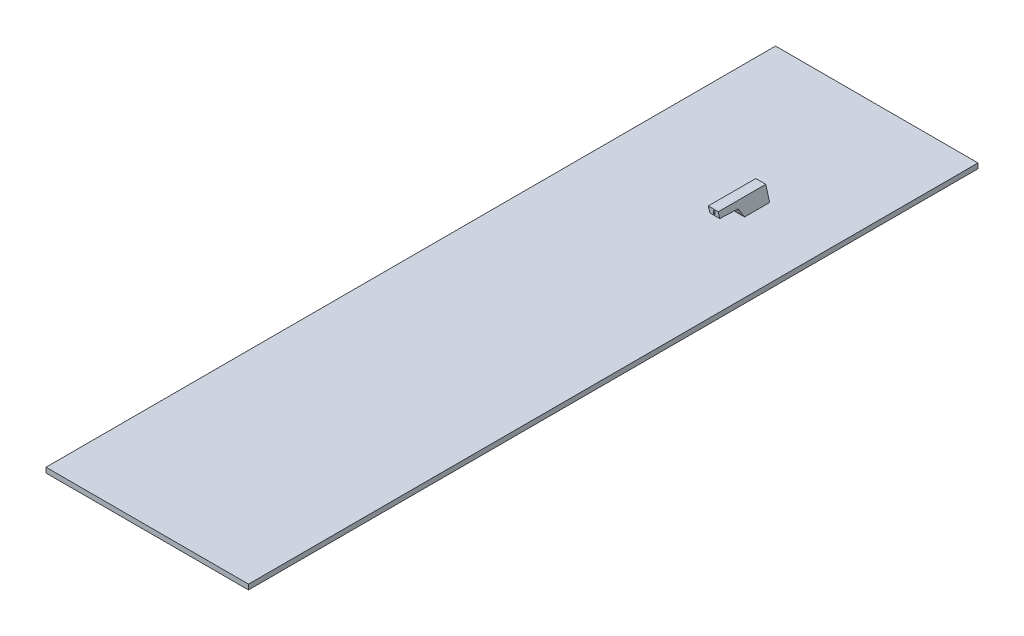
ISO-10303-21;
HEADER;
FILE_DESCRIPTION(('STEP AP214'),'2;1');
FILE_NAME('part.step','',(''),(''),'','','');
FILE_SCHEMA(('AUTOMOTIVE_DESIGN { 1 0 10303 214 1 1 1 1 }'));
ENDSEC;
DATA;
#1=APPLICATION_CONTEXT('core data for automotive mechanical design processes');
#2=APPLICATION_PROTOCOL_DEFINITION('international standard','automotive_design',2000,#1);
#3=PRODUCT_CONTEXT('',#1,'mechanical');
#4=PRODUCT('Part','Part','',(#3));
#5=PRODUCT_RELATED_PRODUCT_CATEGORY('part','',(#4));
#6=PRODUCT_DEFINITION_FORMATION('','',#4);
#7=PRODUCT_DEFINITION_CONTEXT('part definition',#1,'design');
#8=PRODUCT_DEFINITION('design','',#6,#7);
#9=PRODUCT_DEFINITION_SHAPE('','',#8);
#10=(LENGTH_UNIT() NAMED_UNIT(*) SI_UNIT(.MILLI.,.METRE.));
#11=(NAMED_UNIT(*) PLANE_ANGLE_UNIT() SI_UNIT($,.RADIAN.));
#12=(NAMED_UNIT(*) SI_UNIT($,.STERADIAN.) SOLID_ANGLE_UNIT());
#13=UNCERTAINTY_MEASURE_WITH_UNIT(LENGTH_MEASURE(1.E-05),#10,'distance_accuracy_value','');
#14=(GEOMETRIC_REPRESENTATION_CONTEXT(3) GLOBAL_UNCERTAINTY_ASSIGNED_CONTEXT((#13)) GLOBAL_UNIT_ASSIGNED_CONTEXT((#10,
#11,#12)) REPRESENTATION_CONTEXT('',''));
#15=CARTESIAN_POINT('',(0.,0.,0.));
#16=DIRECTION('',(0.,0.,1.));
#17=DIRECTION('',(1.,0.,0.));
#18=AXIS2_PLACEMENT_3D('',#15,#16,#17);
#19=CARTESIAN_POINT('',(79.5934517566759,140.935265317445,459.688927372495));
#20=CARTESIAN_POINT('',(67.7143056578116,242.605545870488,459.688927372495));
#21=CARTESIAN_POINT('',(33.8252863264388,339.461806899819,459.688927372495));
#22=B_SPLINE_CURVE_WITH_KNOTS('',2,(#19,#20,#21),.UNSPECIFIED.,.F.,.F.,(3,3),(0.,1.),.UNSPECIFIED.);
#23=DIRECTION('',(0.,0.,-1.));
#24=VECTOR('',#23,1.);
#25=SURFACE_OF_LINEAR_EXTRUSION('',#22,#24);
#26=CARTESIAN_POINT('',(38.5140972952893,325.721466306331,-111.234969945832));
#27=CARTESIAN_POINT('',(38.437626661458,325.951367208587,-119.164899377774));
#28=CARTESIAN_POINT('',(38.3645743574073,326.170687110974,-127.095184239526));
#29=CARTESIAN_POINT('',(38.2267521524108,326.584009234564,-142.955362789571));
#30=CARTESIAN_POINT('',(38.1619810836154,326.778015025731,-150.885256375026));
#31=CARTESIAN_POINT('',(38.0421525824308,327.136596871235,-166.744744815686));
#32=CARTESIAN_POINT('',(37.9870938716534,327.301176798786,-174.674339572648));
#33=CARTESIAN_POINT('',(37.8881338780025,327.596766004807,-190.53331168074));
#34=CARTESIAN_POINT('',(37.8442313036847,327.72777916901,-198.462688950692));
#35=CARTESIAN_POINT('',(37.7690230476383,327.952095321626,-214.321310459757));
#36=CARTESIAN_POINT('',(37.7377162010686,328.045401797122,-222.25055464333));
#37=CARTESIAN_POINT('',(37.6891335578531,328.190154295036,-238.108993683911));
#38=CARTESIAN_POINT('',(37.6718569075715,328.241602864205,-246.038188514563));
#39=CARTESIAN_POINT('',(37.6527563257277,328.298481131611,-261.897558176938));
#40=CARTESIAN_POINT('',(37.6509339286345,328.303906260133,-269.827733027796));
#41=CARTESIAN_POINT('',(37.664152833935,328.264545048095,-285.688040418021));
#42=CARTESIAN_POINT('',(37.6791943205655,328.219758158973,-293.61817295598));
#43=CARTESIAN_POINT('',(37.7275225316437,328.07578070229,-309.47831828599));
#44=CARTESIAN_POINT('',(37.760810219339,327.976587262516,-317.408331049614));
#45=CARTESIAN_POINT('',(37.8469786262215,327.719588381993,-333.268157082847));
#46=CARTESIAN_POINT('',(37.8998614364754,327.561776685872,-341.197970240804));
#47=CARTESIAN_POINT('',(38.026532302006,327.183313725697,-357.057325602944));
#48=CARTESIAN_POINT('',(38.1003239869242,326.962651551184,-364.986867520805));
#49=CARTESIAN_POINT('',(38.2700568601046,326.454241506788,-380.845577828932));
#50=CARTESIAN_POINT('',(38.3660036824556,326.166476572376,-388.774745610173));
#51=CARTESIAN_POINT('',(38.4736337559906,325.843086245644,-396.702344949578));
#52=B_SPLINE_CURVE_WITH_KNOTS('',3,(#26,#27,#28,#29,#30,#31,#32,#33,#34,#35,#36,#37,#38,#39,#40,
#41,#42,#43,#44,#45,#46,#47,#48,#49,#50,#51),.UNSPECIFIED.,.F.,.F.,(4,2,2,2,2,2,2,2,2,2,2,2,4),
(0.,23.8009053738766,47.5984505479361,71.3928610314598,95.184515796958,118.973969826648,
142.761976331963,166.552344745917,190.34297307063,214.134857463656,237.929281506792,
261.727838636703,285.532454457821),.UNSPECIFIED.);
#53=CARTESIAN_POINT('',(38.0650432552607,327.068074339287,-360.906787209581));
#54=VERTEX_POINT('',#53);
#55=CARTESIAN_POINT('',(38.4736337559906,325.843086245644,-396.702344949578));
#56=VERTEX_POINT('',#55);
#57=EDGE_CURVE('E627',#54,#56,#52,.T.);
#58=ORIENTED_EDGE('',*,*,#57,.F.);
#59=CARTESIAN_POINT('',(79.5934517566759,140.935265317445,-360.906787209581));
#60=CARTESIAN_POINT('',(67.7143056578116,242.605545870488,-360.906787209581));
#61=CARTESIAN_POINT('',(33.8252863264388,339.461806899819,-360.906787209581));
#62=B_SPLINE_CURVE_WITH_KNOTS('',2,(#59,#60,#61),.UNSPECIFIED.,.F.,.F.,(3,3),(0.,1.),.UNSPECIFIED.);
#63=CARTESIAN_POINT('',(34.5483666432307,337.387451299709,-360.906787209581));
#64=VERTEX_POINT('',#63);
#65=EDGE_CURVE('E540',#54,#64,#62,.T.);
#66=ORIENTED_EDGE('',*,*,#65,.T.);
#67=DIRECTION('',(0.,0.,-1.));
#68=VECTOR('',#67,1.);
#69=CARTESIAN_POINT('',(34.5483666432307,337.387451299709,-75.3342967017252));
#70=LINE('',#69,#68);
#71=CARTESIAN_POINT('',(34.5483666432307,337.387451299709,-454.761806193869));
#72=VERTEX_POINT('',#71);
#73=EDGE_CURVE('E577',#72,#64,#70,.F.);
#74=ORIENTED_EDGE('',*,*,#73,.F.);
#75=CARTESIAN_POINT('',(79.5934517566759,140.935265317445,-454.761806193869));
#76=CARTESIAN_POINT('',(67.7143056578116,242.605545870488,-454.761806193869));
#77=CARTESIAN_POINT('',(33.8252863264388,339.461806899819,-454.761806193869));
#78=B_SPLINE_CURVE_WITH_KNOTS('',2,(#75,#76,#77),.UNSPECIFIED.,.F.,.F.,(3,3),(0.,1.),.UNSPECIFIED.);
#79=CARTESIAN_POINT('',(70.3217503939318,202.387451299709,-454.761806193869));
#80=VERTEX_POINT('',#79);
#81=EDGE_CURVE('E565',#72,#80,#78,.F.);
#82=ORIENTED_EDGE('',*,*,#81,.T.);
#83=DIRECTION('',(0.,0.,-1.));
#84=VECTOR('',#83,1.);
#85=CARTESIAN_POINT('',(70.3217503939318,202.387451299709,-70.3342967017253));
#86=LINE('',#85,#84);
#87=CARTESIAN_POINT('',(70.3217503939318,202.387451299709,-447.578435289618));
#88=VERTEX_POINT('',#87);
#89=EDGE_CURVE('E555',#88,#80,#86,.T.);
#90=ORIENTED_EDGE('',*,*,#89,.F.);
#91=CARTESIAN_POINT('',(38.4736337559906,325.843086245644,-396.702344949578));
#92=CARTESIAN_POINT('',(38.9584839184503,324.38610798305,-397.447935172854));
#93=CARTESIAN_POINT('',(39.4385423418659,322.931595866912,-398.201396477603));
#94=CARTESIAN_POINT('',(40.3894280205216,320.026679721807,-399.721334992262));
#95=CARTESIAN_POINT('',(40.8602567557569,318.576275066647,-400.487810077992));
#96=CARTESIAN_POINT('',(41.7931573938862,315.678386292773,-402.031235633349));
#97=CARTESIAN_POINT('',(42.2552299415383,314.23090196609,-402.808185324414));
#98=CARTESIAN_POINT('',(43.1710690215722,311.337636662465,-404.370022116335));
#99=CARTESIAN_POINT('',(43.6248357306443,309.891855649902,-405.154909047788));
#100=CARTESIAN_POINT('',(44.5244907967608,307.000773464142,-406.730072624566));
#101=CARTESIAN_POINT('',(44.9703791169935,305.555472293217,-407.520349295049));
#102=CARTESIAN_POINT('',(45.8571061509451,302.656187229764,-409.108072167472));
#103=CARTESIAN_POINT('',(46.297903667263,301.202199256602,-409.905533905662));
#104=CARTESIAN_POINT('',(47.1723334567549,298.292180183213,-411.500700268472));
#105=CARTESIAN_POINT('',(47.605965647168,296.836149059597,-412.298404895788));
#106=CARTESIAN_POINT('',(48.4664325413267,293.920749987264,-413.891416297326));
#107=CARTESIAN_POINT('',(48.8932671824787,292.461382007961,-414.686723049413));
#108=CARTESIAN_POINT('',(49.7404853889204,289.53799415632,-416.272271617596));
#109=CARTESIAN_POINT('',(50.1608688555401,288.073974213243,-417.062513356116));
#110=CARTESIAN_POINT('',(50.9955090946448,285.139945642721,-418.635231536367));
#111=CARTESIAN_POINT('',(51.4097656252179,283.669936781721,-419.417707671087));
#112=CARTESIAN_POINT('',(52.3227804956322,280.398971802628,-421.142824305082));
#113=CARTESIAN_POINT('',(52.8201105809464,278.596254408291,-422.082888184023));
#114=CARTESIAN_POINT('',(53.8064965078835,274.977808494563,-423.94211564808));
#115=CARTESIAN_POINT('',(54.2955523746532,273.162080014738,-424.86127929672));
#116=CARTESIAN_POINT('',(55.265734679631,269.515481358888,-426.673336507971));
#117=CARTESIAN_POINT('',(55.7468612948684,267.684611522284,-427.566230657429));
#118=CARTESIAN_POINT('',(56.7014888551707,264.005545701919,-429.320290545344));
#119=CARTESIAN_POINT('',(57.1749892143537,262.157348404081,-430.181453852584));
#120=CARTESIAN_POINT('',(58.1136918372846,258.445077682737,-431.864827909167));
#121=CARTESIAN_POINT('',(58.5789066134075,256.581035845106,-432.687101173868));
#122=CARTESIAN_POINT('',(59.5018945856153,252.832480661043,-434.288346950098));
#123=CARTESIAN_POINT('',(59.9596674928468,250.9479665247,-435.067317783685));
#124=CARTESIAN_POINT('',(60.8676383276218,247.157494243875,-436.575824950016));
#125=CARTESIAN_POINT('',(61.3178365693379,245.251536994284,-437.305363336875));
#126=CARTESIAN_POINT('',(62.2105003920174,241.417201144212,-438.70894928058));
#127=CARTESIAN_POINT('',(62.6529651979382,239.488820328334,-439.382991300432));
#128=CARTESIAN_POINT('',(63.4470749596945,235.975457444201,-440.548026471712));
#129=CARTESIAN_POINT('',(63.8001130822115,234.394287666367,-441.049569797783));
#130=CARTESIAN_POINT('',(64.5006083850284,231.217233299033,-442.008794949266));
#131=CARTESIAN_POINT('',(64.8480649322347,229.621347072177,-442.466471827934));
#132=CARTESIAN_POINT('',(65.5370316808232,226.415569554429,-443.334721171995));
#133=CARTESIAN_POINT('',(65.8785420715032,224.805678711836,-443.74529513926));
#134=CARTESIAN_POINT('',(66.5552572427827,221.572653273728,-444.516339292928));
#135=CARTESIAN_POINT('',(66.8904622142394,219.949519081213,-444.876810997983));
#136=CARTESIAN_POINT('',(67.5542107412835,216.690841070692,-445.544915997961));
#137=CARTESIAN_POINT('',(67.882753562728,215.055295912044,-445.852543497266));
#138=CARTESIAN_POINT('',(68.5323647798582,211.775040504894,-446.412118664537));
#139=CARTESIAN_POINT('',(68.853440646803,210.130341655691,-446.664124338184));
#140=CARTESIAN_POINT('',(69.4880661615326,206.831457692586,-447.110755828358));
#141=CARTESIAN_POINT('',(69.8016147207114,205.177271248929,-447.305373390741));
#142=CARTESIAN_POINT('',(70.4206627017679,201.861581087701,-447.635436935361));
#143=CARTESIAN_POINT('',(70.7261625582531,200.2000777709,-447.770886118704));
#144=CARTESIAN_POINT('',(71.3286296875006,196.871986169218,-447.981333951025));
#145=CARTESIAN_POINT('',(71.6255983627087,195.205398770519,-448.056342591334));
#146=CARTESIAN_POINT('',(72.2105696532281,191.869375703062,-448.145142386293));
#147=CARTESIAN_POINT('',(72.4985742796881,190.19994076313,-448.158947372174));
#148=CARTESIAN_POINT('',(72.9711192021459,187.415123512057,-448.130725814065));
#149=CARTESIAN_POINT('',(73.1582380034721,186.299975737016,-448.105727840482));
#150=CARTESIAN_POINT('',(73.528224145125,184.069976813294,-448.028381354288));
#151=CARTESIAN_POINT('',(73.7110917292412,182.955125651246,-447.976034414088));
#152=CARTESIAN_POINT('',(74.0724898796233,180.726343902683,-447.844120855604));
#153=CARTESIAN_POINT('',(74.2510204766288,179.612413309697,-447.764554430307));
#154=CARTESIAN_POINT('',(74.6036728187011,177.386070387944,-447.578421653052));
#155=CARTESIAN_POINT('',(74.7777944041841,176.273658115507,-447.471854325333));
#156=CARTESIAN_POINT('',(75.1215655230601,174.05094948487,-447.232020792192));
#157=CARTESIAN_POINT('',(75.2912147612073,172.940653270831,-447.098752829077));
#158=CARTESIAN_POINT('',(75.6259876234303,170.722767951838,-446.805897355018));
#159=CARTESIAN_POINT('',(75.7911109015558,169.615179059686,-446.646307838642));
#160=CARTESIAN_POINT('',(76.117665477047,167.397331032015,-446.300331969172));
#161=CARTESIAN_POINT('',(76.2790717245089,166.287090282995,-446.11380420388));
#162=CARTESIAN_POINT('',(76.5972274234097,164.070537289946,-445.715135409209));
#163=CARTESIAN_POINT('',(76.7539768205232,162.96422509188,-445.502994081176));
#164=CARTESIAN_POINT('',(77.0627957015579,160.756086477227,-445.053690954218));
#165=CARTESIAN_POINT('',(77.2148653658232,159.654259889201,-444.816530121041));
#166=CARTESIAN_POINT('',(77.5143110129461,157.455637148356,-444.317839266701));
#167=CARTESIAN_POINT('',(77.6616875467463,156.3588404181,-444.056312120239));
#168=CARTESIAN_POINT('',(77.9517411456943,154.170814237142,-443.509591682211));
#169=CARTESIAN_POINT('',(78.0944192797471,153.079583568551,-443.224403826246));
#170=CARTESIAN_POINT('',(78.3750812032734,150.903204699462,-442.63111928635));
#171=CARTESIAN_POINT('',(78.5130667320417,149.818054372663,-442.323031228193));
#172=CARTESIAN_POINT('',(78.6487442965423,148.735919190394,-442.003790333663));
#173=B_SPLINE_CURVE_WITH_KNOTS('',3,(#91,#92,#93,#94,#95,#96,#97,#98,#99,#100,#101,#102,#103,
#104,#105,#106,#107,#108,#109,#110,#111,#112,#113,#114,#115,#116,#117,#118,#119,#120,#121,#122,
#123,#124,#125,#126,#127,#128,#129,#130,#131,#132,#133,#134,#135,#136,#137,#138,#139,#140,#141,
#142,#143,#144,#145,#146,#147,#148,#149,#150,#151,#152,#153,#154,#155,#156,#157,#158,#159,#160,
#161,#162,#163,#164,#165,#166,#167,#168,#169,#170,#171,#172),.UNSPECIFIED.,.F.,.F.,(4,2,2,2,2,2,
2,2,2,2,2,2,2,2,2,2,2,2,2,2,2,2,2,2,2,2,2,2,2,2,2,2,2,2,2,2,2,2,2,2,4),(0.,5.1208638424298,
10.2408997160588,15.3605571014901,20.4801054494494,25.5996777120652,30.7473749254374,
35.8951315541801,41.0429355574721,46.1908182175151,51.3389035932913,57.6179140712577,
63.896905462806,70.1757564785526,76.4550875836656,82.7239554778923,88.9930661177299,
95.2619160909096,101.531390764903,106.618689666425,111.706561580593,116.794271223445,
121.881826618935,126.969939629554,132.052721121837,137.136233315538,142.219470448853,
147.301867107736,152.383115152354,155.775848681306,159.16838716893,162.560901604056,
165.953538655834,169.346399117187,172.739518199014,176.151144627591,179.562810839524,
182.974345410217,186.385478001717,189.795829108491,193.20490209198),.UNSPECIFIED.);
#174=EDGE_CURVE('E617',#56,#88,#173,.T.);
#175=ORIENTED_EDGE('',*,*,#174,.F.);
#176=EDGE_LOOP('',(#58,#66,#74,#82,#90,#175));
#177=FACE_BOUND('',#176,.T.);
#178=ADVANCED_FACE('F340',(#177),#25,.T.);
#179=CARTESIAN_POINT('',(38.8064860248671,394.0012038353,482.120102696812));
#180=DIRECTION('',(0.964308162620724,0.2647824909299,0.));
#181=DIRECTION('',(-0.2647824909299,0.964308162620724,0.));
#182=AXIS2_PLACEMENT_3D('',#179,#180,#181);
#183=PLANE('',#182);
#184=DIRECTION('',(0.,0.,-1.));
#185=VECTOR('',#184,1.);
#186=CARTESIAN_POINT('',(54.3516519773393,337.387451299709,482.120102696812));
#187=LINE('',#186,#185);
#188=CARTESIAN_POINT('',(54.3516519773393,337.387451299709,-360.906787209581));
#189=VERTEX_POINT('',#188);
#190=CARTESIAN_POINT('',(54.3516519773394,337.387451299709,-454.761806193869));
#191=VERTEX_POINT('',#190);
#192=EDGE_CURVE('E571',#189,#191,#187,.T.);
#193=ORIENTED_EDGE('',*,*,#192,.F.);
#194=DIRECTION('',(0.2647824909299,-0.964308162620724,0.));
#195=VECTOR('',#194,1.);
#196=CARTESIAN_POINT('',(38.8064860248671,394.0012038353,-360.906787209581));
#197=LINE('',#196,#195);
#198=CARTESIAN_POINT('',(57.1851759921099,327.068074339287,-360.906787209581));
#199=VERTEX_POINT('',#198);
#200=EDGE_CURVE('E528',#189,#199,#197,.T.);
#201=ORIENTED_EDGE('',*,*,#200,.T.);
#202=CARTESIAN_POINT('',(57.5549314739086,325.721466306331,-111.234969945833));
#203=CARTESIAN_POINT('',(57.4918047168908,325.951366881926,-119.164887560702));
#204=CARTESIAN_POINT('',(57.4315834033685,326.170686157869,-127.09515023914));
#205=CARTESIAN_POINT('',(57.3180924152876,326.584007619594,-142.95529824084));
#206=CARTESIAN_POINT('',(57.26482179191,326.778013260868,-150.885183467583));
#207=CARTESIAN_POINT('',(57.166361339062,327.136595197473,-166.744665638109));
#208=CARTESIAN_POINT('',(57.1211704805823,327.30117524034,-174.674262489829));
#209=CARTESIAN_POINT('',(57.0400066253274,327.596764906625,-190.533246230297));
#210=CARTESIAN_POINT('',(57.0040325965398,327.727778288516,-198.462633043062));
#211=CARTESIAN_POINT('',(56.942439085988,327.952094952284,-214.321278001243));
#212=CARTESIAN_POINT('',(56.9168186782461,328.045401606468,-222.250536094717));
#213=CARTESIAN_POINT('',(56.8770720388095,328.190154413615,-238.109004323216));
#214=CARTESIAN_POINT('',(56.8629451307638,328.241603029772,-246.0382144336));
#215=CARTESIAN_POINT('',(56.8473273754259,328.298481144716,-261.897582079219));
#216=CARTESIAN_POINT('',(56.8458377413092,328.303906225253,-269.827739632332));
#217=CARTESIAN_POINT('',(56.8566456227973,328.264545131915,-285.688014236913));
#218=CARTESIAN_POINT('',(56.8689432846305,328.219758425494,-293.61813128706));
#219=CARTESIAN_POINT('',(56.9084768981074,328.075781435022,-309.478249928888));
#220=CARTESIAN_POINT('',(56.9357136125221,327.976588373046,-317.408251493996));
#221=CARTESIAN_POINT('',(57.006280931187,327.719590105661,-333.268061738919));
#222=CARTESIAN_POINT('',(57.0496131963937,327.561778851235,-341.197870314332));
#223=CARTESIAN_POINT('',(57.1535325133596,327.183316343188,-357.05722511917));
#224=CARTESIAN_POINT('',(57.214122463392,326.962654534381,-364.986771080593));
#225=CARTESIAN_POINT('',(57.3537232515783,326.454244106322,-380.845500157229));
#226=CARTESIAN_POINT('',(57.4327386265696,326.166478964416,-388.774682701237));
#227=CARTESIAN_POINT('',(57.5215367234271,325.843086245644,-396.702344949578));
#228=B_SPLINE_CURVE_WITH_KNOTS('',3,(#202,#203,#204,#205,#206,#207,#208,#209,#210,#211,#212,
#213,#214,#215,#216,#217,#218,#219,#220,#221,#222,#223,#224,#225,#226,#227),.UNSPECIFIED.,.F.,
.F.,(4,2,2,2,2,2,2,2,2,2,2,2,4),(0.,23.8005171082993,47.5977818689919,71.3920137348638,
95.183580185069,118.973018361819,142.761056514682,166.551378288316,190.341952384985,
214.133741314139,237.927986083973,261.726229241878,285.530338369131),.UNSPECIFIED.);
#229=CARTESIAN_POINT('',(57.5215367234271,325.843086245644,-396.702344949578));
#230=VERTEX_POINT('',#229);
#231=EDGE_CURVE('E581',#199,#230,#228,.T.);
#232=ORIENTED_EDGE('',*,*,#231,.T.);
#233=CARTESIAN_POINT('',(57.5215367234271,325.843086245644,-396.702344949578));
#234=CARTESIAN_POINT('',(57.981803763976,324.1668452577,-397.56014798294));
#235=CARTESIAN_POINT('',(58.4407917705317,322.495262368242,-398.427639647813));
#236=CARTESIAN_POINT('',(59.3567533659955,319.159432872678,-400.178170563667));
#237=CARTESIAN_POINT('',(59.8137267144935,317.495187142119,-401.061211610559));
#238=CARTESIAN_POINT('',(60.7261629226138,314.172196712234,-402.838941007174));
#239=CARTESIAN_POINT('',(61.1816255502585,312.513452857745,-403.733631050391));
#240=CARTESIAN_POINT('',(62.0915488238945,309.199614253673,-405.530792512672));
#241=CARTESIAN_POINT('',(62.5460093286333,307.544520018517,-406.433264950377));
#242=CARTESIAN_POINT('',(63.4544342282834,304.236138324606,-408.242126133553));
#243=CARTESIAN_POINT('',(63.9083985754119,302.582851039871,-409.148515220617));
#244=CARTESIAN_POINT('',(64.816337782022,299.27623818559,-410.961343847237));
#245=CARTESIAN_POINT('',(65.2703126414063,297.622912616398,-411.86778338749));
#246=CARTESIAN_POINT('',(66.192839732392,294.263172321819,-413.704832533274));
#247=CARTESIAN_POINT('',(66.6614086528628,292.556696817439,-414.63532282593));
#248=CARTESIAN_POINT('',(67.5996575024221,289.139699639785,-416.487970646186));
#249=CARTESIAN_POINT('',(68.0693373455949,287.429178279406,-417.410128793193));
#250=CARTESIAN_POINT('',(69.010371747456,284.002036432396,-419.241815389679));
#251=CARTESIAN_POINT('',(69.4817261557778,282.285416493382,-420.151344938849));
#252=CARTESIAN_POINT('',(70.4266786129197,278.844005528064,-421.953438489313));
#253=CARTESIAN_POINT('',(70.9002765497769,277.119214909516,-422.846003326315));
#254=CARTESIAN_POINT('',(71.8502914632823,273.659367045379,-424.60978366163));
#255=CARTESIAN_POINT('',(72.3267086023271,271.92430920836,-425.480997914911));
#256=CARTESIAN_POINT('',(73.282944853999,268.441803927732,-427.19763603249));
#257=CARTESIAN_POINT('',(73.762764801017,266.694353445366,-428.043053281303));
#258=CARTESIAN_POINT('',(74.7317268237685,263.165502332411,-429.712772023404));
#259=CARTESIAN_POINT('',(75.2209124350917,261.383943150085,-430.536713996415));
#260=CARTESIAN_POINT('',(76.2035798259371,257.805178622243,-432.148220887785));
#261=CARTESIAN_POINT('',(76.697062354075,256.007970550354,-432.935779310287));
#262=CARTESIAN_POINT('',(77.6885380060494,252.397127322462,-434.469169436466));
#263=CARTESIAN_POINT('',(78.1865309347942,250.583492876961,-435.215002934983));
#264=CARTESIAN_POINT('',(79.1872337211334,246.939045459629,-436.659670125449));
#265=CARTESIAN_POINT('',(79.6899431446926,245.108234068506,-437.358508094743));
#266=CARTESIAN_POINT('',(80.7002738545876,241.428722832409,-438.704018919145));
#267=CARTESIAN_POINT('',(81.2078953857581,239.580022095776,-439.350689158895));
#268=CARTESIAN_POINT('',(82.2282316877124,235.864071614544,-440.58683899024));
#269=CARTESIAN_POINT('',(82.7409483861034,233.996814849816,-441.176295952368));
#270=CARTESIAN_POINT('',(83.7622529840826,230.27733794296,-442.282994699416));
#271=CARTESIAN_POINT('',(84.2707592962933,228.42541493292,-442.801307728146));
#272=CARTESIAN_POINT('',(85.2923113393132,224.705036858953,-443.773087055866));
#273=CARTESIAN_POINT('',(85.8053586871086,222.836575906144,-444.226529180655));
#274=CARTESIAN_POINT('',(86.8353729506776,219.085379373144,-445.064061989933));
#275=CARTESIAN_POINT('',(87.3523395338796,217.202645004141,-445.448158491691));
#276=CARTESIAN_POINT('',(88.3895406214341,213.425274863483,-446.143176852684));
#277=CARTESIAN_POINT('',(88.9097739635771,211.530643324463,-446.454123372681));
#278=CARTESIAN_POINT('',(89.952817316788,207.73199630692,-446.999752139789));
#279=CARTESIAN_POINT('',(90.4756261381755,205.827985161078,-447.234466758881));
#280=CARTESIAN_POINT('',(91.5231081775683,202.013172945823,-447.625308914242));
#281=CARTESIAN_POINT('',(92.0477805855189,200.102374826537,-447.78146718177));
#282=CARTESIAN_POINT('',(92.9485323396401,196.821937868854,-447.980598681798));
#283=CARTESIAN_POINT('',(93.324316098909,195.453375524831,-448.043150199131));
#284=CARTESIAN_POINT('',(94.0762110427615,192.715058390477,-448.127027460748));
#285=CARTESIAN_POINT('',(94.452322227245,191.345303600511,-448.148353217619));
#286=CARTESIAN_POINT('',(95.2045641955124,188.605722642123,-448.149659217698));
#287=CARTESIAN_POINT('',(95.5806949794565,187.235896473117,-448.129637726324));
#288=CARTESIAN_POINT('',(96.332677295193,184.497261140152,-448.048344930635));
#289=CARTESIAN_POINT('',(96.7085287991219,183.128452077668,-447.987069951603));
#290=CARTESIAN_POINT('',(97.459653464575,180.392940210934,-447.823564011879));
#291=CARTESIAN_POINT('',(97.8349265470739,179.026237694485,-447.721327880326));
#292=CARTESIAN_POINT('',(98.5845968611426,176.29602241253,-447.47638476051));
#293=CARTESIAN_POINT('',(98.9589939630029,174.932510119412,-447.333672119256));
#294=CARTESIAN_POINT('',(99.7171924981052,172.171236012055,-447.003839326389));
#295=CARTESIAN_POINT('',(100.100958957316,170.77360156932,-446.815572852867));
#296=CARTESIAN_POINT('',(100.866925287896,167.984038021227,-446.397862504026));
#297=CARTESIAN_POINT('',(101.249125118124,166.592109065703,-446.168417554294));
#298=CARTESIAN_POINT('',(102.011664392306,163.815026473006,-445.66942218079));
#299=CARTESIAN_POINT('',(102.392003920971,162.429872527325,-445.399873601086));
#300=CARTESIAN_POINT('',(103.150536737613,159.667381004057,-444.821891903372));
#301=CARTESIAN_POINT('',(103.528730377338,158.290042145442,-444.513465362552));
#302=CARTESIAN_POINT('',(104.282690857855,155.544202558005,-443.859078225707));
#303=CARTESIAN_POINT('',(104.658458502375,154.175698902092,-443.513130816225));
#304=CARTESIAN_POINT('',(105.407300157058,151.448501504765,-442.785183816631));
#305=CARTESIAN_POINT('',(105.780375638374,150.089802405579,-442.403205823924));
#306=CARTESIAN_POINT('',(106.152128760499,148.735919190394,-442.003790333663));
#307=B_SPLINE_CURVE_WITH_KNOTS('',3,(#233,#234,#235,#236,#237,#238,#239,#240,#241,#242,#243,
#244,#245,#246,#247,#248,#249,#250,#251,#252,#253,#254,#255,#256,#257,#258,#259,#260,#261,#262,
#263,#264,#265,#266,#267,#268,#269,#270,#271,#272,#273,#274,#275,#276,#277,#278,#279,#280,#281,
#282,#283,#284,#285,#286,#287,#288,#289,#290,#291,#292,#293,#294,#295,#296,#297,#298,#299,#300,
#301,#302,#303,#304,#305,#306),.UNSPECIFIED.,.F.,.F.,(4,2,2,2,2,2,2,2,2,2,2,2,2,2,2,2,2,2,2,2,2,
2,2,2,2,2,2,2,2,2,2,2,2,2,2,2,4),(0.,5.81515392051098,11.6309839385361,17.4476690993077,
23.2651275280099,29.0831040047542,34.901256418227,40.8993157814695,46.896925522457,
52.8940096778867,58.8907976380655,64.8879344649112,70.8865965120558,76.9549634893406,
83.0244097483548,89.0935947230818,95.1622265551757,101.23116244106,107.302489063294,
113.268976174098,119.237680942293,125.205884774579,131.172073677558,137.135725707637,
143.097042938173,147.358272488464,151.619500737718,155.880907755978,160.142694415881,
164.405019245627,168.667939649468,173.051956929523,177.436088612399,181.820018764161,
186.203208256321,190.584862257234,194.963906304171),.UNSPECIFIED.);
#308=CARTESIAN_POINT('',(91.4203377576086,202.387451299709,-447.578435289619));
#309=VERTEX_POINT('',#308);
#310=EDGE_CURVE('E589',#230,#309,#307,.T.);
#311=ORIENTED_EDGE('',*,*,#310,.T.);
#312=DIRECTION('',(0.,0.,1.));
#313=VECTOR('',#312,1.);
#314=CARTESIAN_POINT('',(91.4203377576086,202.387451299709,482.120102696812));
#315=LINE('',#314,#313);
#316=CARTESIAN_POINT('',(91.4203377576086,202.387451299709,-454.761806193869));
#317=VERTEX_POINT('',#316);
#318=EDGE_CURVE('E552',#317,#309,#315,.T.);
#319=ORIENTED_EDGE('',*,*,#318,.F.);
#320=DIRECTION('',(-0.2647824909299,0.964308162620724,0.));
#321=VECTOR('',#320,1.);
#322=CARTESIAN_POINT('',(38.8064860248671,394.0012038353,-454.761806193869));
#323=LINE('',#322,#321);
#324=EDGE_CURVE('E561',#317,#191,#323,.T.);
#325=ORIENTED_EDGE('',*,*,#324,.T.);
#326=EDGE_LOOP('',(#193,#201,#232,#311,#319,#325));
#327=FACE_BOUND('',#326,.T.);
#328=ADVANCED_FACE('F604',(#327),#183,.T.);
#329=CARTESIAN_POINT('',(0.,337.387451299709,0.));
#330=DIRECTION('',(0.,-1.,0.));
#331=DIRECTION('',(0.,0.,-1.));
#332=AXIS2_PLACEMENT_3D('',#329,#330,#331);
#333=PLANE('',#332);
#334=DIRECTION('',(-1.,0.,0.));
#335=VECTOR('',#334,1.);
#336=CARTESIAN_POINT('',(0.,337.387451299709,-360.906787209581));
#337=LINE('',#336,#335);
#338=EDGE_CURVE('E546',#189,#64,#337,.T.);
#339=ORIENTED_EDGE('',*,*,#338,.F.);
#340=ORIENTED_EDGE('',*,*,#192,.T.);
#341=DIRECTION('',(1.,0.,0.));
#342=VECTOR('',#341,1.);
#343=CARTESIAN_POINT('',(0.,337.387451299709,-454.761806193869));
#344=LINE('',#343,#342);
#345=EDGE_CURVE('E650',#72,#191,#344,.T.);
#346=ORIENTED_EDGE('',*,*,#345,.F.);
#347=ORIENTED_EDGE('',*,*,#73,.T.);
#348=EDGE_LOOP('',(#339,#340,#346,#347));
#349=FACE_BOUND('',#348,.T.);
#350=ADVANCED_FACE('F602',(#349),#333,.F.);
#351=CARTESIAN_POINT('',(-321.200733720247,120.735265523539,412.255506908933));
#352=CARTESIAN_POINT('',(-321.200733720247,184.28998488035,347.945615604378));
#353=CARTESIAN_POINT('',(-321.200733720247,260.118965510706,243.198199319056));
#354=CARTESIAN_POINT('',(-321.200733720247,315.383822661597,107.441933730423));
#355=CARTESIAN_POINT('',(-321.200733720247,321.489904749579,13.0570049985076));
#356=CARTESIAN_POINT('',(-321.200733720247,324.056750228038,-55.482106564492));
#357=CARTESIAN_POINT('',(-321.200733720247,329.770066062198,-245.254817305456));
#358=CARTESIAN_POINT('',(-321.200733720247,330.105519590004,-395.293106061705));
#359=CARTESIAN_POINT('',(-321.200733720247,316.677995768092,-529.808763742509));
#360=B_SPLINE_CURVE_WITH_KNOTS('',3,(#351,#352,#353,#354,#355,#356,#357,#358,#359),
.UNSPECIFIED.,.F.,.F.,(4,1,1,1,1,1,4),(0.,0.268354736053871,0.388679730465141,0.430559092744216,
0.551186882643778,0.59467935564418,1.),.UNSPECIFIED.);
#361=DIRECTION('',(1.,0.,0.));
#362=VECTOR('',#361,1.);
#363=SURFACE_OF_LINEAR_EXTRUSION('',#360,#362);
#364=ORIENTED_EDGE('',*,*,#231,.F.);
#365=DIRECTION('',(1.,0.,0.));
#366=VECTOR('',#365,1.);
#367=CARTESIAN_POINT('',(47.5799637548638,327.068074339287,-360.906787209581));
#368=LINE('',#367,#366);
#369=EDGE_CURVE('E14',#199,#54,#368,.F.);
#370=ORIENTED_EDGE('',*,*,#369,.T.);
#371=ORIENTED_EDGE('',*,*,#57,.T.);
#372=DIRECTION('',(1.,0.,0.));
#373=VECTOR('',#372,1.);
#374=CARTESIAN_POINT('',(-321.200733720247,325.843086245644,-396.702344949578));
#375=LINE('',#374,#373);
#376=EDGE_CURVE('E633',#56,#230,#375,.T.);
#377=ORIENTED_EDGE('',*,*,#376,.T.);
#378=EDGE_LOOP('',(#364,#370,#371,#377));
#379=FACE_BOUND('',#378,.T.);
#380=ADVANCED_FACE('F595',(#379),#363,.T.);
#381=CARTESIAN_POINT('',(-321.200733720247,325.843086245644,-396.702344949578));
#382=CARTESIAN_POINT('',(-321.200733720247,271.169157877603,-424.681134442918));
#383=CARTESIAN_POINT('',(-321.200733720247,220.85932905127,-463.28052885355));
#384=CARTESIAN_POINT('',(-321.200733720247,148.735919190394,-442.003790333663));
#385=B_SPLINE_CURVE_WITH_KNOTS('',3,(#381,#382,#383,#384),.UNSPECIFIED.,.F.,.F.,(4,4),(0.,1.),.UNSPECIFIED.);
#386=DIRECTION('',(1.,0.,0.));
#387=VECTOR('',#386,1.);
#388=SURFACE_OF_LINEAR_EXTRUSION('',#385,#387);
#389=DIRECTION('',(1.,0.,0.));
#390=VECTOR('',#389,1.);
#391=CARTESIAN_POINT('',(72.3128812582449,202.387451299709,-447.578435289618));
#392=LINE('',#391,#390);
#393=EDGE_CURVE('E558',#309,#88,#392,.F.);
#394=ORIENTED_EDGE('',*,*,#393,.F.);
#395=ORIENTED_EDGE('',*,*,#310,.F.);
#396=ORIENTED_EDGE('',*,*,#376,.F.);
#397=ORIENTED_EDGE('',*,*,#174,.T.);
#398=EDGE_LOOP('',(#394,#395,#396,#397));
#399=FACE_BOUND('',#398,.T.);
#400=ADVANCED_FACE('F342',(#399),#388,.T.);
#401=CARTESIAN_POINT('',(0.,0.,-454.761806193869));
#402=DIRECTION('',(0.,0.,-1.));
#403=DIRECTION('',(-1.,0.,0.));
#404=AXIS2_PLACEMENT_3D('',#401,#402,#403);
#405=PLANE('',#404);
#406=DIRECTION('',(1.,0.,0.));
#407=VECTOR('',#406,1.);
#408=CARTESIAN_POINT('',(0.,202.387451299709,-454.761806193869));
#409=LINE('',#408,#407);
#410=EDGE_CURVE('E351',#80,#317,#409,.T.);
#411=ORIENTED_EDGE('',*,*,#410,.F.);
#412=ORIENTED_EDGE('',*,*,#81,.F.);
#413=ORIENTED_EDGE('',*,*,#345,.T.);
#414=ORIENTED_EDGE('',*,*,#324,.F.);
#415=EDGE_LOOP('',(#411,#412,#413,#414));
#416=FACE_BOUND('',#415,.T.);
#417=ADVANCED_FACE('F665',(#416),#405,.T.);
#418=CARTESIAN_POINT('',(0.,202.387451299709,0.));
#419=DIRECTION('',(0.,1.,0.));
#420=DIRECTION('',(0.,0.,1.));
#421=AXIS2_PLACEMENT_3D('',#418,#419,#420);
#422=PLANE('',#421);
#423=DIRECTION('',(-1.,0.,0.));
#424=VECTOR('',#423,1.);
#425=CARTESIAN_POINT('',(77.8710440757702,202.387451299709,-448.170120741744));
#426=LINE('',#425,#424);
#427=CARTESIAN_POINT('',(83.8710440757702,202.387451299709,-448.170120741744));
#428=VERTEX_POINT('',#427);
#429=CARTESIAN_POINT('',(77.8710440757702,202.387451299709,-448.170120741744));
#430=VERTEX_POINT('',#429);
#431=EDGE_CURVE('E480',#428,#430,#426,.T.);
#432=ORIENTED_EDGE('',*,*,#431,.F.);
#433=DIRECTION('',(0.,0.,1.));
#434=VECTOR('',#433,1.);
#435=CARTESIAN_POINT('',(83.8710440757702,202.387451299709,-454.170120741744));
#436=LINE('',#435,#434);
#437=CARTESIAN_POINT('',(83.8710440757702,202.387451299709,-454.170120741744));
#438=VERTEX_POINT('',#437);
#439=EDGE_CURVE('E358',#438,#428,#436,.T.);
#440=ORIENTED_EDGE('',*,*,#439,.F.);
#441=DIRECTION('',(1.,0.,0.));
#442=VECTOR('',#441,1.);
#443=CARTESIAN_POINT('',(77.8710440757702,202.387451299709,-454.170120741744));
#444=LINE('',#443,#442);
#445=CARTESIAN_POINT('',(77.8710440757702,202.387451299709,-454.170120741744));
#446=VERTEX_POINT('',#445);
#447=EDGE_CURVE('E467',#446,#438,#444,.T.);
#448=ORIENTED_EDGE('',*,*,#447,.F.);
#449=DIRECTION('',(0.,0.,-1.));
#450=VECTOR('',#449,1.);
#451=CARTESIAN_POINT('',(77.8710440757702,202.387451299709,-454.170120741744));
#452=LINE('',#451,#450);
#453=EDGE_CURVE('E471',#430,#446,#452,.T.);
#454=ORIENTED_EDGE('',*,*,#453,.F.);
#455=EDGE_LOOP('',(#432,#440,#448,#454));
#456=FACE_BOUND('',#455,.T.);
#457=ORIENTED_EDGE('',*,*,#393,.T.);
#458=ORIENTED_EDGE('',*,*,#89,.T.);
#459=ORIENTED_EDGE('',*,*,#410,.T.);
#460=ORIENTED_EDGE('',*,*,#318,.T.);
#461=EDGE_LOOP('',(#457,#458,#459,#460));
#462=FACE_BOUND('',#461,.T.);
#463=ADVANCED_FACE('F657',(#456,#462),#422,.F.);
#464=CARTESIAN_POINT('',(0.,0.,-360.906787209581));
#465=DIRECTION('',(0.,0.,1.));
#466=DIRECTION('',(1.,0.,0.));
#467=AXIS2_PLACEMENT_3D('',#464,#465,#466);
#468=PLANE('',#467);
#469=DIRECTION('',(0.,1.,0.));
#470=VECTOR('',#469,1.);
#471=CARTESIAN_POINT('',(47.5654228732989,329.137204108034,-360.906787209581));
#472=LINE('',#471,#470);
#473=CARTESIAN_POINT('',(47.5654228732989,329.137204108034,-360.906787209581));
#474=VERTEX_POINT('',#473);
#475=CARTESIAN_POINT('',(47.5654228732989,335.137204108034,-360.906787209581));
#476=VERTEX_POINT('',#475);
#477=EDGE_CURVE('E366',#474,#476,#472,.T.);
#478=ORIENTED_EDGE('',*,*,#477,.F.);
#479=DIRECTION('',(1.,0.,0.));
#480=VECTOR('',#479,1.);
#481=CARTESIAN_POINT('',(44.5654228732989,329.137204108034,-360.906787209581));
#482=LINE('',#481,#480);
#483=CARTESIAN_POINT('',(44.5654228732989,329.137204108034,-360.906787209581));
#484=VERTEX_POINT('',#483);
#485=EDGE_CURVE('E499',#484,#474,#482,.T.);
#486=ORIENTED_EDGE('',*,*,#485,.F.);
#487=DIRECTION('',(0.,-1.,0.));
#488=VECTOR('',#487,1.);
#489=CARTESIAN_POINT('',(44.5654228732989,329.137204108034,-360.906787209581));
#490=LINE('',#489,#488);
#491=CARTESIAN_POINT('',(44.5654228732989,335.137204108034,-360.906787209581));
#492=VERTEX_POINT('',#491);
#493=EDGE_CURVE('E518',#492,#484,#490,.T.);
#494=ORIENTED_EDGE('',*,*,#493,.F.);
#495=DIRECTION('',(-1.,0.,0.));
#496=VECTOR('',#495,1.);
#497=CARTESIAN_POINT('',(44.5654228732989,335.137204108034,-360.906787209581));
#498=LINE('',#497,#496);
#499=EDGE_CURVE('E514',#476,#492,#498,.T.);
#500=ORIENTED_EDGE('',*,*,#499,.F.);
#501=EDGE_LOOP('',(#478,#486,#494,#500));
#502=FACE_BOUND('',#501,.T.);
#503=ORIENTED_EDGE('',*,*,#338,.T.);
#504=ORIENTED_EDGE('',*,*,#65,.F.);
#505=ORIENTED_EDGE('',*,*,#369,.F.);
#506=ORIENTED_EDGE('',*,*,#200,.F.);
#507=EDGE_LOOP('',(#503,#504,#505,#506));
#508=FACE_BOUND('',#507,.T.);
#509=ADVANCED_FACE('F673',(#502,#508),#468,.T.);
#510=CARTESIAN_POINT('',(47.5654228732989,329.137204108034,-365.906787209581));
#511=DIRECTION('',(1.,0.,0.));
#512=DIRECTION('',(0.,0.,-1.));
#513=AXIS2_PLACEMENT_3D('',#510,#511,#512);
#514=PLANE('',#513);
#515=ORIENTED_EDGE('',*,*,#477,.T.);
#516=DIRECTION('',(0.,0.,1.));
#517=VECTOR('',#516,1.);
#518=CARTESIAN_POINT('',(47.5654228732989,335.137204108034,-365.906787209581));
#519=LINE('',#518,#517);
#520=CARTESIAN_POINT('',(47.5654228732989,335.137204108034,-365.906787209581));
#521=VERTEX_POINT('',#520);
#522=EDGE_CURVE('E511',#521,#476,#519,.T.);
#523=ORIENTED_EDGE('',*,*,#522,.F.);
#524=DIRECTION('',(0.,1.,0.));
#525=VECTOR('',#524,1.);
#526=CARTESIAN_POINT('',(47.5654228732989,329.137204108034,-365.906787209581));
#527=LINE('',#526,#525);
#528=CARTESIAN_POINT('',(47.5654228732989,329.137204108034,-365.906787209581));
#529=VERTEX_POINT('',#528);
#530=EDGE_CURVE('E494',#529,#521,#527,.T.);
#531=ORIENTED_EDGE('',*,*,#530,.F.);
#532=DIRECTION('',(0.,0.,1.));
#533=VECTOR('',#532,1.);
#534=CARTESIAN_POINT('',(47.5654228732989,329.137204108034,-365.906787209581));
#535=LINE('',#534,#533);
#536=EDGE_CURVE('E525',#529,#474,#535,.T.);
#537=ORIENTED_EDGE('',*,*,#536,.T.);
#538=EDGE_LOOP('',(#515,#523,#531,#537));
#539=FACE_BOUND('',#538,.T.);
#540=ADVANCED_FACE('F715',(#539),#514,.F.);
#541=CARTESIAN_POINT('',(44.5654228732989,329.137204108034,-365.906787209581));
#542=DIRECTION('',(0.,-1.,0.));
#543=DIRECTION('',(0.,0.,-1.));
#544=AXIS2_PLACEMENT_3D('',#541,#542,#543);
#545=PLANE('',#544);
#546=ORIENTED_EDGE('',*,*,#485,.T.);
#547=ORIENTED_EDGE('',*,*,#536,.F.);
#548=DIRECTION('',(1.,0.,0.));
#549=VECTOR('',#548,1.);
#550=CARTESIAN_POINT('',(44.5654228732989,329.137204108034,-365.906787209581));
#551=LINE('',#550,#549);
#552=CARTESIAN_POINT('',(44.5654228732989,329.137204108034,-365.906787209581));
#553=VERTEX_POINT('',#552);
#554=EDGE_CURVE('E507',#553,#529,#551,.T.);
#555=ORIENTED_EDGE('',*,*,#554,.F.);
#556=DIRECTION('',(0.,0.,1.));
#557=VECTOR('',#556,1.);
#558=CARTESIAN_POINT('',(44.5654228732989,329.137204108034,-365.906787209581));
#559=LINE('',#558,#557);
#560=EDGE_CURVE('E529',#553,#484,#559,.T.);
#561=ORIENTED_EDGE('',*,*,#560,.T.);
#562=EDGE_LOOP('',(#546,#547,#555,#561));
#563=FACE_BOUND('',#562,.T.);
#564=ADVANCED_FACE('F725',(#563),#545,.F.);
#565=CARTESIAN_POINT('',(44.5654228732989,329.137204108034,-365.906787209581));
#566=DIRECTION('',(-1.,0.,0.));
#567=DIRECTION('',(0.,0.,1.));
#568=AXIS2_PLACEMENT_3D('',#565,#566,#567);
#569=PLANE('',#568);
#570=ORIENTED_EDGE('',*,*,#493,.T.);
#571=ORIENTED_EDGE('',*,*,#560,.F.);
#572=DIRECTION('',(0.,-1.,0.));
#573=VECTOR('',#572,1.);
#574=CARTESIAN_POINT('',(44.5654228732989,329.137204108034,-365.906787209581));
#575=LINE('',#574,#573);
#576=CARTESIAN_POINT('',(44.5654228732989,335.137204108034,-365.906787209581));
#577=VERTEX_POINT('',#576);
#578=EDGE_CURVE('E503',#577,#553,#575,.T.);
#579=ORIENTED_EDGE('',*,*,#578,.F.);
#580=DIRECTION('',(0.,0.,1.));
#581=VECTOR('',#580,1.);
#582=CARTESIAN_POINT('',(44.5654228732989,335.137204108034,-365.906787209581));
#583=LINE('',#582,#581);
#584=EDGE_CURVE('E532',#577,#492,#583,.T.);
#585=ORIENTED_EDGE('',*,*,#584,.T.);
#586=EDGE_LOOP('',(#570,#571,#579,#585));
#587=FACE_BOUND('',#586,.T.);
#588=ADVANCED_FACE('F731',(#587),#569,.F.);
#589=CARTESIAN_POINT('',(44.5654228732989,335.137204108034,-365.906787209581));
#590=DIRECTION('',(0.,1.,0.));
#591=DIRECTION('',(0.,0.,1.));
#592=AXIS2_PLACEMENT_3D('',#589,#590,#591);
#593=PLANE('',#592);
#594=ORIENTED_EDGE('',*,*,#499,.T.);
#595=ORIENTED_EDGE('',*,*,#584,.F.);
#596=DIRECTION('',(-1.,0.,0.));
#597=VECTOR('',#596,1.);
#598=CARTESIAN_POINT('',(44.5654228732989,335.137204108034,-365.906787209581));
#599=LINE('',#598,#597);
#600=EDGE_CURVE('E498',#521,#577,#599,.T.);
#601=ORIENTED_EDGE('',*,*,#600,.F.);
#602=ORIENTED_EDGE('',*,*,#522,.T.);
#603=EDGE_LOOP('',(#594,#595,#601,#602));
#604=FACE_BOUND('',#603,.T.);
#605=ADVANCED_FACE('F739',(#604),#593,.F.);
#606=CARTESIAN_POINT('',(0.,0.,-365.906787209581));
#607=DIRECTION('',(0.,0.,-1.));
#608=DIRECTION('',(-1.,0.,0.));
#609=AXIS2_PLACEMENT_3D('',#606,#607,#608);
#610=PLANE('',#609);
#611=ORIENTED_EDGE('',*,*,#530,.T.);
#612=ORIENTED_EDGE('',*,*,#600,.T.);
#613=ORIENTED_EDGE('',*,*,#578,.T.);
#614=ORIENTED_EDGE('',*,*,#554,.T.);
#615=EDGE_LOOP('',(#611,#612,#613,#614));
#616=FACE_BOUND('',#615,.T.);
#617=ADVANCED_FACE('F747',(#616),#610,.F.);
#618=CARTESIAN_POINT('',(83.8710440757702,207.387451299709,-454.170120741744));
#619=DIRECTION('',(1.,0.,0.));
#620=DIRECTION('',(0.,0.,-1.));
#621=AXIS2_PLACEMENT_3D('',#618,#619,#620);
#622=PLANE('',#621);
#623=ORIENTED_EDGE('',*,*,#439,.T.);
#624=DIRECTION('',(0.,-1.,0.));
#625=VECTOR('',#624,1.);
#626=CARTESIAN_POINT('',(83.8710440757702,207.387451299709,-448.170120741744));
#627=LINE('',#626,#625);
#628=CARTESIAN_POINT('',(83.8710440757702,207.387451299709,-448.170120741744));
#629=VERTEX_POINT('',#628);
#630=EDGE_CURVE('E442',#629,#428,#627,.T.);
#631=ORIENTED_EDGE('',*,*,#630,.F.);
#632=DIRECTION('',(0.,0.,1.));
#633=VECTOR('',#632,1.);
#634=CARTESIAN_POINT('',(83.8710440757702,207.387451299709,-454.170120741744));
#635=LINE('',#634,#633);
#636=CARTESIAN_POINT('',(83.8710440757702,207.387451299709,-454.170120741744));
#637=VERTEX_POINT('',#636);
#638=EDGE_CURVE('E446',#637,#629,#635,.T.);
#639=ORIENTED_EDGE('',*,*,#638,.F.);
#640=DIRECTION('',(0.,-1.,0.));
#641=VECTOR('',#640,1.);
#642=CARTESIAN_POINT('',(83.8710440757702,207.387451299709,-454.170120741744));
#643=LINE('',#642,#641);
#644=EDGE_CURVE('E486',#637,#438,#643,.T.);
#645=ORIENTED_EDGE('',*,*,#644,.T.);
#646=EDGE_LOOP('',(#623,#631,#639,#645));
#647=FACE_BOUND('',#646,.T.);
#648=ADVANCED_FACE('F444',(#647),#622,.F.);
#649=CARTESIAN_POINT('',(77.8710440757702,207.387451299709,-454.170120741744));
#650=DIRECTION('',(0.,0.,-1.));
#651=DIRECTION('',(-1.,0.,0.));
#652=AXIS2_PLACEMENT_3D('',#649,#650,#651);
#653=PLANE('',#652);
#654=ORIENTED_EDGE('',*,*,#447,.T.);
#655=ORIENTED_EDGE('',*,*,#644,.F.);
#656=DIRECTION('',(1.,0.,0.));
#657=VECTOR('',#656,1.);
#658=CARTESIAN_POINT('',(77.8710440757702,207.387451299709,-454.170120741744));
#659=LINE('',#658,#657);
#660=CARTESIAN_POINT('',(77.8710440757702,207.387451299709,-454.170120741744));
#661=VERTEX_POINT('',#660);
#662=EDGE_CURVE('E453',#661,#637,#659,.T.);
#663=ORIENTED_EDGE('',*,*,#662,.F.);
#664=DIRECTION('',(0.,-1.,0.));
#665=VECTOR('',#664,1.);
#666=CARTESIAN_POINT('',(77.8710440757702,207.387451299709,-454.170120741744));
#667=LINE('',#666,#665);
#668=EDGE_CURVE('E489',#661,#446,#667,.T.);
#669=ORIENTED_EDGE('',*,*,#668,.T.);
#670=EDGE_LOOP('',(#654,#655,#663,#669));
#671=FACE_BOUND('',#670,.T.);
#672=ADVANCED_FACE('F760',(#671),#653,.F.);
#673=CARTESIAN_POINT('',(77.8710440757702,207.387451299709,-454.170120741744));
#674=DIRECTION('',(-1.,0.,0.));
#675=DIRECTION('',(0.,0.,1.));
#676=AXIS2_PLACEMENT_3D('',#673,#674,#675);
#677=PLANE('',#676);
#678=ORIENTED_EDGE('',*,*,#453,.T.);
#679=ORIENTED_EDGE('',*,*,#668,.F.);
#680=DIRECTION('',(0.,0.,-1.));
#681=VECTOR('',#680,1.);
#682=CARTESIAN_POINT('',(77.8710440757702,207.387451299709,-454.170120741744));
#683=LINE('',#682,#681);
#684=CARTESIAN_POINT('',(77.8710440757702,207.387451299709,-448.170120741744));
#685=VERTEX_POINT('',#684);
#686=EDGE_CURVE('E462',#685,#661,#683,.T.);
#687=ORIENTED_EDGE('',*,*,#686,.F.);
#688=DIRECTION('',(0.,-1.,0.));
#689=VECTOR('',#688,1.);
#690=CARTESIAN_POINT('',(77.8710440757702,207.387451299709,-448.170120741744));
#691=LINE('',#690,#689);
#692=EDGE_CURVE('E452',#685,#430,#691,.T.);
#693=ORIENTED_EDGE('',*,*,#692,.T.);
#694=EDGE_LOOP('',(#678,#679,#687,#693));
#695=FACE_BOUND('',#694,.T.);
#696=ADVANCED_FACE('F767',(#695),#677,.F.);
#697=CARTESIAN_POINT('',(77.8710440757702,207.387451299709,-448.170120741744));
#698=DIRECTION('',(0.,0.,1.));
#699=DIRECTION('',(1.,0.,0.));
#700=AXIS2_PLACEMENT_3D('',#697,#698,#699);
#701=PLANE('',#700);
#702=ORIENTED_EDGE('',*,*,#431,.T.);
#703=ORIENTED_EDGE('',*,*,#692,.F.);
#704=DIRECTION('',(-1.,0.,0.));
#705=VECTOR('',#704,1.);
#706=CARTESIAN_POINT('',(77.8710440757702,207.387451299709,-448.170120741744));
#707=LINE('',#706,#705);
#708=EDGE_CURVE('E456',#629,#685,#707,.T.);
#709=ORIENTED_EDGE('',*,*,#708,.F.);
#710=ORIENTED_EDGE('',*,*,#630,.T.);
#711=EDGE_LOOP('',(#702,#703,#709,#710));
#712=FACE_BOUND('',#711,.T.);
#713=ADVANCED_FACE('F457',(#712),#701,.F.);
#714=CARTESIAN_POINT('',(0.,207.387451299709,0.));
#715=DIRECTION('',(0.,1.,0.));
#716=DIRECTION('',(0.,0.,1.));
#717=AXIS2_PLACEMENT_3D('',#714,#715,#716);
#718=PLANE('',#717);
#719=ORIENTED_EDGE('',*,*,#638,.T.);
#720=ORIENTED_EDGE('',*,*,#708,.T.);
#721=ORIENTED_EDGE('',*,*,#686,.T.);
#722=ORIENTED_EDGE('',*,*,#662,.T.);
#723=EDGE_LOOP('',(#719,#720,#721,#722));
#724=FACE_BOUND('',#723,.T.);
#725=ADVANCED_FACE('F464',(#724),#718,.F.);
#726=CLOSED_SHELL('',(#178,#328,#350,#380,#400,#417,#463,#509,#540,#564,#588,#605,#617,#648,
#672,#696,#713,#725));
#727=MANIFOLD_SOLID_BREP('B2',#726);
#728=CARTESIAN_POINT('',(-200.,310.,712.77097818594));
#729=DIRECTION('',(1.,0.,0.));
#730=DIRECTION('',(0.,0.,-1.));
#731=AXIS2_PLACEMENT_3D('',#728,#729,#730);
#732=PLANE('',#731);
#733=DIRECTION('',(0.,0.,1.));
#734=VECTOR('',#733,1.);
#735=CARTESIAN_POINT('',(-200.,300.,712.77097818594));
#736=LINE('',#735,#734);
#737=CARTESIAN_POINT('',(-200.,300.,-728.257150163641));
#738=VERTEX_POINT('',#737);
#739=CARTESIAN_POINT('',(-200.,300.,712.77097818594));
#740=VERTEX_POINT('',#739);
#741=EDGE_CURVE('E924',#738,#740,#736,.T.);
#742=ORIENTED_EDGE('',*,*,#741,.T.);
#743=DIRECTION('',(0.,-1.,0.));
#744=VECTOR('',#743,1.);
#745=CARTESIAN_POINT('',(-200.,310.,712.77097818594));
#746=LINE('',#745,#744);
#747=CARTESIAN_POINT('',(-200.,310.,712.77097818594));
#748=VERTEX_POINT('',#747);
#749=EDGE_CURVE('E338',#748,#740,#746,.T.);
#750=ORIENTED_EDGE('',*,*,#749,.F.);
#751=DIRECTION('',(0.,0.,1.));
#752=VECTOR('',#751,1.);
#753=CARTESIAN_POINT('',(-200.,310.,712.77097818594));
#754=LINE('',#753,#752);
#755=CARTESIAN_POINT('',(-200.,310.,-728.257150163641));
#756=VERTEX_POINT('',#755);
#757=EDGE_CURVE('E912',#756,#748,#754,.T.);
#758=ORIENTED_EDGE('',*,*,#757,.F.);
#759=DIRECTION('',(0.,-1.,0.));
#760=VECTOR('',#759,1.);
#761=CARTESIAN_POINT('',(-200.,310.,-728.257150163641));
#762=LINE('',#761,#760);
#763=EDGE_CURVE('E920',#756,#738,#762,.T.);
#764=ORIENTED_EDGE('',*,*,#763,.T.);
#765=EDGE_LOOP('',(#742,#750,#758,#764));
#766=FACE_BOUND('',#765,.T.);
#767=ADVANCED_FACE('F861',(#766),#732,.F.);
#768=CARTESIAN_POINT('',(-200.,310.,712.77097818594));
#769=DIRECTION('',(0.,0.,-1.));
#770=DIRECTION('',(-1.,0.,0.));
#771=AXIS2_PLACEMENT_3D('',#768,#769,#770);
#772=PLANE('',#771);
#773=DIRECTION('',(1.,0.,0.));
#774=VECTOR('',#773,1.);
#775=CARTESIAN_POINT('',(-200.,300.,712.77097818594));
#776=LINE('',#775,#774);
#777=CARTESIAN_POINT('',(200.,300.,712.77097818594));
#778=VERTEX_POINT('',#777);
#779=EDGE_CURVE('E916',#740,#778,#776,.T.);
#780=ORIENTED_EDGE('',*,*,#779,.T.);
#781=DIRECTION('',(0.,-1.,0.));
#782=VECTOR('',#781,1.);
#783=CARTESIAN_POINT('',(200.,310.,712.77097818594));
#784=LINE('',#783,#782);
#785=CARTESIAN_POINT('',(200.,310.,712.77097818594));
#786=VERTEX_POINT('',#785);
#787=EDGE_CURVE('E869',#786,#778,#784,.T.);
#788=ORIENTED_EDGE('',*,*,#787,.F.);
#789=DIRECTION('',(1.,0.,0.));
#790=VECTOR('',#789,1.);
#791=CARTESIAN_POINT('',(-200.,310.,712.77097818594));
#792=LINE('',#791,#790);
#793=EDGE_CURVE('E907',#748,#786,#792,.T.);
#794=ORIENTED_EDGE('',*,*,#793,.F.);
#795=ORIENTED_EDGE('',*,*,#749,.T.);
#796=EDGE_LOOP('',(#780,#788,#794,#795));
#797=FACE_BOUND('',#796,.T.);
#798=ADVANCED_FACE('F915',(#797),#772,.F.);
#799=CARTESIAN_POINT('',(200.,310.,712.77097818594));
#800=DIRECTION('',(-1.,0.,0.));
#801=DIRECTION('',(0.,0.,1.));
#802=AXIS2_PLACEMENT_3D('',#799,#800,#801);
#803=PLANE('',#802);
#804=DIRECTION('',(0.,0.,-1.));
#805=VECTOR('',#804,1.);
#806=CARTESIAN_POINT('',(200.,300.,712.77097818594));
#807=LINE('',#806,#805);
#808=CARTESIAN_POINT('',(200.,300.,-728.257150163641));
#809=VERTEX_POINT('',#808);
#810=EDGE_CURVE('E894',#778,#809,#807,.T.);
#811=ORIENTED_EDGE('',*,*,#810,.T.);
#812=DIRECTION('',(0.,-1.,0.));
#813=VECTOR('',#812,1.);
#814=CARTESIAN_POINT('',(200.,310.,-728.257150163641));
#815=LINE('',#814,#813);
#816=CARTESIAN_POINT('',(200.,310.,-728.257150163641));
#817=VERTEX_POINT('',#816);
#818=EDGE_CURVE('E917',#817,#809,#815,.T.);
#819=ORIENTED_EDGE('',*,*,#818,.F.);
#820=DIRECTION('',(0.,0.,-1.));
#821=VECTOR('',#820,1.);
#822=CARTESIAN_POINT('',(200.,310.,712.77097818594));
#823=LINE('',#822,#821);
#824=EDGE_CURVE('E910',#786,#817,#823,.T.);
#825=ORIENTED_EDGE('',*,*,#824,.F.);
#826=ORIENTED_EDGE('',*,*,#787,.T.);
#827=EDGE_LOOP('',(#811,#819,#825,#826));
#828=FACE_BOUND('',#827,.T.);
#829=ADVANCED_FACE('F918',(#828),#803,.F.);
#830=CARTESIAN_POINT('',(-200.,310.,-728.257150163641));
#831=DIRECTION('',(0.,0.,1.));
#832=DIRECTION('',(1.,0.,0.));
#833=AXIS2_PLACEMENT_3D('',#830,#831,#832);
#834=PLANE('',#833);
#835=DIRECTION('',(-1.,0.,0.));
#836=VECTOR('',#835,1.);
#837=CARTESIAN_POINT('',(-200.,300.,-728.257150163641));
#838=LINE('',#837,#836);
#839=EDGE_CURVE('E900',#809,#738,#838,.T.);
#840=ORIENTED_EDGE('',*,*,#839,.T.);
#841=ORIENTED_EDGE('',*,*,#763,.F.);
#842=DIRECTION('',(-1.,0.,0.));
#843=VECTOR('',#842,1.);
#844=CARTESIAN_POINT('',(-200.,310.,-728.257150163641));
#845=LINE('',#844,#843);
#846=EDGE_CURVE('E877',#817,#756,#845,.T.);
#847=ORIENTED_EDGE('',*,*,#846,.F.);
#848=ORIENTED_EDGE('',*,*,#818,.T.);
#849=EDGE_LOOP('',(#840,#841,#847,#848));
#850=FACE_BOUND('',#849,.T.);
#851=ADVANCED_FACE('F931',(#850),#834,.F.);
#852=CARTESIAN_POINT('',(0.,310.,0.));
#853=DIRECTION('',(0.,-1.,0.));
#854=DIRECTION('',(0.,0.,-1.));
#855=AXIS2_PLACEMENT_3D('',#852,#853,#854);
#856=PLANE('',#855);
#857=ORIENTED_EDGE('',*,*,#757,.T.);
#858=ORIENTED_EDGE('',*,*,#793,.T.);
#859=ORIENTED_EDGE('',*,*,#824,.T.);
#860=ORIENTED_EDGE('',*,*,#846,.T.);
#861=EDGE_LOOP('',(#857,#858,#859,#860));
#862=FACE_BOUND('',#861,.T.);
#863=ADVANCED_FACE('F908',(#862),#856,.F.);
#864=CARTESIAN_POINT('',(0.,300.,0.));
#865=DIRECTION('',(0.,-1.,0.));
#866=DIRECTION('',(0.,0.,-1.));
#867=AXIS2_PLACEMENT_3D('',#864,#865,#866);
#868=PLANE('',#867);
#869=ORIENTED_EDGE('',*,*,#741,.F.);
#870=ORIENTED_EDGE('',*,*,#839,.F.);
#871=ORIENTED_EDGE('',*,*,#810,.F.);
#872=ORIENTED_EDGE('',*,*,#779,.F.);
#873=EDGE_LOOP('',(#869,#870,#871,#872));
#874=FACE_BOUND('',#873,.T.);
#875=ADVANCED_FACE('F934',(#874),#868,.T.);
#876=CLOSED_SHELL('',(#767,#798,#829,#851,#863,#875));
#877=MANIFOLD_SOLID_BREP('B8_NOT_SHOWN',#876);
#878=ADVANCED_BREP_SHAPE_REPRESENTATION('',(#18,#727,#877),#14);
#879=SHAPE_DEFINITION_REPRESENTATION(#9,#878);
ENDSEC;
END-ISO-10303-21;
